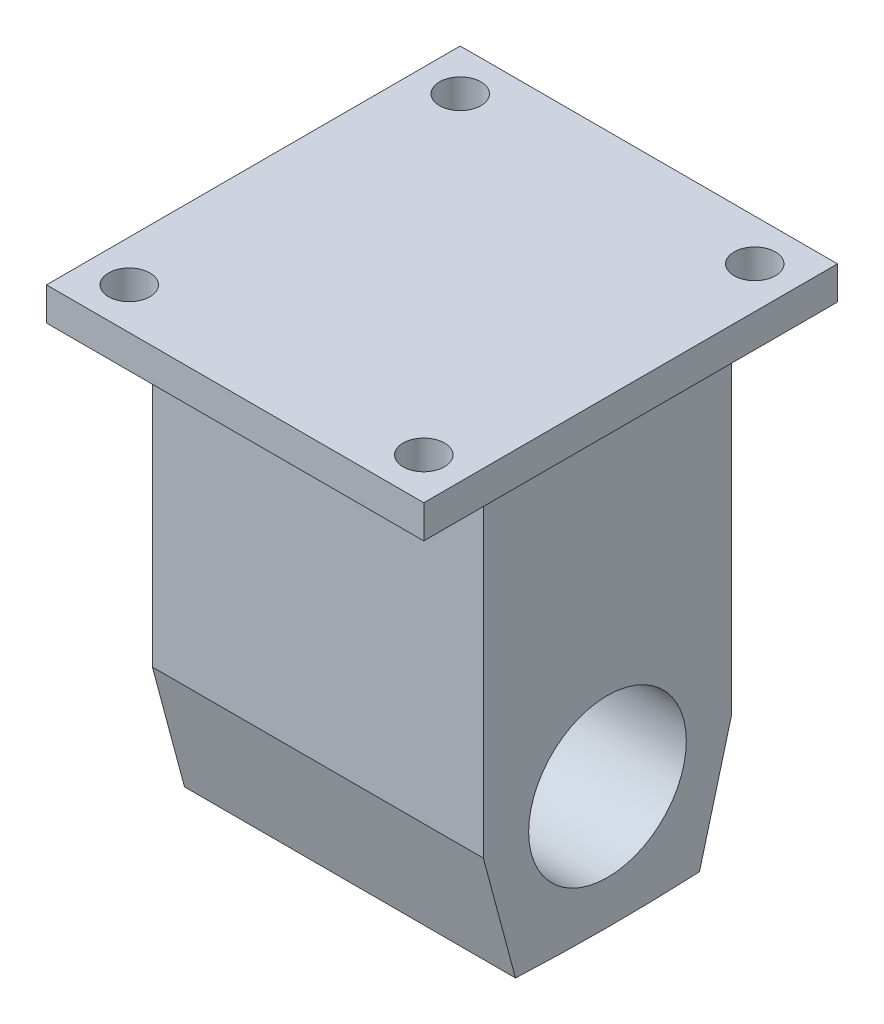
ISO-10303-21;
HEADER;
FILE_DESCRIPTION(('STEP AP214'),'2;1');
FILE_NAME('part.step','',(''),(''),'','','');
FILE_SCHEMA(('AUTOMOTIVE_DESIGN { 1 0 10303 214 1 1 1 1 }'));
ENDSEC;
DATA;
#1=APPLICATION_CONTEXT('core data for automotive mechanical design processes');
#2=APPLICATION_PROTOCOL_DEFINITION('international standard','automotive_design',2000,#1);
#3=PRODUCT_CONTEXT('',#1,'mechanical');
#4=PRODUCT('Part','Part','',(#3));
#5=PRODUCT_RELATED_PRODUCT_CATEGORY('part','',(#4));
#6=PRODUCT_DEFINITION_FORMATION('','',#4);
#7=PRODUCT_DEFINITION_CONTEXT('part definition',#1,'design');
#8=PRODUCT_DEFINITION('design','',#6,#7);
#9=PRODUCT_DEFINITION_SHAPE('','',#8);
#10=(LENGTH_UNIT() NAMED_UNIT(*) SI_UNIT(.MILLI.,.METRE.));
#11=(NAMED_UNIT(*) PLANE_ANGLE_UNIT() SI_UNIT($,.RADIAN.));
#12=(NAMED_UNIT(*) SI_UNIT($,.STERADIAN.) SOLID_ANGLE_UNIT());
#13=UNCERTAINTY_MEASURE_WITH_UNIT(LENGTH_MEASURE(1.E-05),#10,'distance_accuracy_value','');
#14=(GEOMETRIC_REPRESENTATION_CONTEXT(3) GLOBAL_UNCERTAINTY_ASSIGNED_CONTEXT((#13)) GLOBAL_UNIT_ASSIGNED_CONTEXT((#10,
#11,#12)) REPRESENTATION_CONTEXT('',''));
#15=CARTESIAN_POINT('',(0.,0.,0.));
#16=DIRECTION('',(0.,0.,1.));
#17=DIRECTION('',(1.,0.,0.));
#18=AXIS2_PLACEMENT_3D('',#15,#16,#17);
#19=CARTESIAN_POINT('',(25.4,50.292,19.05));
#20=DIRECTION('',(-1.,0.,0.));
#21=DIRECTION('',(0.,0.,1.));
#22=AXIS2_PLACEMENT_3D('',#19,#20,#21);
#23=PLANE('',#22);
#24=CARTESIAN_POINT('',(25.4,0.,0.));
#25=DIRECTION('',(1.,0.,0.));
#26=DIRECTION('',(0.,0.,-1.));
#27=AXIS2_PLACEMENT_3D('',#24,#25,#26);
#28=CIRCLE('',#27,12.1);
#29=CARTESIAN_POINT('',(25.4,0.,-12.1));
#30=VERTEX_POINT('',#29);
#31=EDGE_CURVE('E132',#30,#30,#28,.T.);
#32=ORIENTED_EDGE('',*,*,#31,.F.);
#33=EDGE_LOOP('',(#32));
#34=FACE_BOUND('',#33,.T.);
#35=DIRECTION('',(0.,-1.,0.));
#36=VECTOR('',#35,1.);
#37=CARTESIAN_POINT('',(25.4,50.292,19.05));
#38=LINE('',#37,#36);
#39=CARTESIAN_POINT('',(25.4,50.292,19.05));
#40=VERTEX_POINT('',#39);
#41=CARTESIAN_POINT('',(25.4,0.,19.05));
#42=VERTEX_POINT('',#41);
#43=EDGE_CURVE('E174',#40,#42,#38,.T.);
#44=ORIENTED_EDGE('',*,*,#43,.T.);
#45=DIRECTION('',(0.,-0.965925826289069,-0.258819045102518));
#46=VECTOR('',#45,1.);
#47=CARTESIAN_POINT('',(25.4,0.,19.05));
#48=LINE('',#47,#46);
#49=CARTESIAN_POINT('',(25.4,-18.4008869908068,14.119497190797));
#50=VERTEX_POINT('',#49);
#51=EDGE_CURVE('E143',#42,#50,#48,.T.);
#52=ORIENTED_EDGE('',*,*,#51,.T.);
#53=CARTESIAN_POINT('',(25.4,281.254621695724,4.34076685363883E-13));
#54=DIRECTION('',(-1.,0.,0.));
#55=DIRECTION('',(0.,0.,1.));
#56=AXIS2_PLACEMENT_3D('',#53,#54,#55);
#57=CIRCLE('',#56,299.987973237435);
#58=CARTESIAN_POINT('',(25.4,-18.4008869908067,-14.119497190797));
#59=VERTEX_POINT('',#58);
#60=EDGE_CURVE('E151',#59,#50,#57,.T.);
#61=ORIENTED_EDGE('',*,*,#60,.F.);
#62=DIRECTION('',(0.,-0.965925826289067,0.258819045102525));
#63=VECTOR('',#62,1.);
#64=CARTESIAN_POINT('',(25.4,0.,-19.05));
#65=LINE('',#64,#63);
#66=CARTESIAN_POINT('',(25.4,0.,-19.05));
#67=VERTEX_POINT('',#66);
#68=EDGE_CURVE('E149',#67,#59,#65,.T.);
#69=ORIENTED_EDGE('',*,*,#68,.F.);
#70=DIRECTION('',(0.,-1.,0.));
#71=VECTOR('',#70,1.);
#72=CARTESIAN_POINT('',(25.4,50.292,-19.05));
#73=LINE('',#72,#71);
#74=CARTESIAN_POINT('',(25.4,50.292,-19.05));
#75=VERTEX_POINT('',#74);
#76=EDGE_CURVE('E11',#75,#67,#73,.T.);
#77=ORIENTED_EDGE('',*,*,#76,.F.);
#78=DIRECTION('',(0.,0.,-1.));
#79=VECTOR('',#78,1.);
#80=CARTESIAN_POINT('',(25.4,50.292,19.05));
#81=LINE('',#80,#79);
#82=EDGE_CURVE('E161',#40,#75,#81,.T.);
#83=ORIENTED_EDGE('',*,*,#82,.F.);
#84=EDGE_LOOP('',(#44,#52,#61,#69,#77,#83));
#85=FACE_BOUND('',#84,.T.);
#86=ADVANCED_FACE('F33',(#34,#85),#23,.F.);
#87=CARTESIAN_POINT('',(-25.4,50.292,-19.05));
#88=DIRECTION('',(0.,0.,1.));
#89=DIRECTION('',(1.,0.,0.));
#90=AXIS2_PLACEMENT_3D('',#87,#88,#89);
#91=PLANE('',#90);
#92=DIRECTION('',(-1.,0.,0.));
#93=VECTOR('',#92,1.);
#94=CARTESIAN_POINT('',(-25.4,0.,-19.05));
#95=LINE('',#94,#93);
#96=CARTESIAN_POINT('',(-25.4,0.,-19.05));
#97=VERTEX_POINT('',#96);
#98=EDGE_CURVE('E160',#67,#97,#95,.T.);
#99=ORIENTED_EDGE('',*,*,#98,.T.);
#100=DIRECTION('',(0.,-1.,0.));
#101=VECTOR('',#100,1.);
#102=CARTESIAN_POINT('',(-25.4,50.292,-19.05));
#103=LINE('',#102,#101);
#104=CARTESIAN_POINT('',(-25.4,50.292,-19.05));
#105=VERTEX_POINT('',#104);
#106=EDGE_CURVE('E42',#105,#97,#103,.T.);
#107=ORIENTED_EDGE('',*,*,#106,.F.);
#108=DIRECTION('',(-1.,0.,0.));
#109=VECTOR('',#108,1.);
#110=CARTESIAN_POINT('',(-25.4,50.292,-19.05));
#111=LINE('',#110,#109);
#112=EDGE_CURVE('E164',#75,#105,#111,.T.);
#113=ORIENTED_EDGE('',*,*,#112,.F.);
#114=ORIENTED_EDGE('',*,*,#76,.T.);
#115=EDGE_LOOP('',(#99,#107,#113,#114));
#116=FACE_BOUND('',#115,.T.);
#117=ADVANCED_FACE('F187',(#116),#91,.F.);
#118=CARTESIAN_POINT('',(-25.4,50.292,19.05));
#119=DIRECTION('',(1.,0.,0.));
#120=DIRECTION('',(0.,0.,-1.));
#121=AXIS2_PLACEMENT_3D('',#118,#119,#120);
#122=PLANE('',#121);
#123=CARTESIAN_POINT('',(-25.4,0.,0.));
#124=DIRECTION('',(1.,0.,0.));
#125=DIRECTION('',(0.,0.,-1.));
#126=AXIS2_PLACEMENT_3D('',#123,#124,#125);
#127=CIRCLE('',#126,12.1);
#128=CARTESIAN_POINT('',(-25.4,0.,-12.1));
#129=VERTEX_POINT('',#128);
#130=EDGE_CURVE('E36',#129,#129,#127,.T.);
#131=ORIENTED_EDGE('',*,*,#130,.T.);
#132=EDGE_LOOP('',(#131));
#133=FACE_BOUND('',#132,.T.);
#134=ORIENTED_EDGE('',*,*,#106,.T.);
#135=DIRECTION('',(0.,-0.965925826289067,0.258819045102525));
#136=VECTOR('',#135,1.);
#137=CARTESIAN_POINT('',(-25.4,0.,-19.05));
#138=LINE('',#137,#136);
#139=CARTESIAN_POINT('',(-25.4,-18.4008869908067,-14.119497190797));
#140=VERTEX_POINT('',#139);
#141=EDGE_CURVE('E140',#97,#140,#138,.T.);
#142=ORIENTED_EDGE('',*,*,#141,.T.);
#143=CARTESIAN_POINT('',(-25.4,281.254621695724,4.34076685363883E-13));
#144=DIRECTION('',(-1.,0.,0.));
#145=DIRECTION('',(0.,0.,1.));
#146=AXIS2_PLACEMENT_3D('',#143,#144,#145);
#147=CIRCLE('',#146,299.987973237435);
#148=CARTESIAN_POINT('',(-25.4,-18.4008869908068,14.119497190797));
#149=VERTEX_POINT('',#148);
#150=EDGE_CURVE('E142',#140,#149,#147,.T.);
#151=ORIENTED_EDGE('',*,*,#150,.T.);
#152=DIRECTION('',(0.,-0.965925826289069,-0.258819045102518));
#153=VECTOR('',#152,1.);
#154=CARTESIAN_POINT('',(-25.4,0.,19.05));
#155=LINE('',#154,#153);
#156=CARTESIAN_POINT('',(-25.4,0.,19.05));
#157=VERTEX_POINT('',#156);
#158=EDGE_CURVE('E145',#157,#149,#155,.T.);
#159=ORIENTED_EDGE('',*,*,#158,.F.);
#160=DIRECTION('',(0.,-1.,0.));
#161=VECTOR('',#160,1.);
#162=CARTESIAN_POINT('',(-25.4,50.292,19.05));
#163=LINE('',#162,#161);
#164=CARTESIAN_POINT('',(-25.4,50.292,19.05));
#165=VERTEX_POINT('',#164);
#166=EDGE_CURVE('E49',#165,#157,#163,.T.);
#167=ORIENTED_EDGE('',*,*,#166,.F.);
#168=DIRECTION('',(0.,0.,1.));
#169=VECTOR('',#168,1.);
#170=CARTESIAN_POINT('',(-25.4,50.292,19.05));
#171=LINE('',#170,#169);
#172=EDGE_CURVE('E168',#105,#165,#171,.T.);
#173=ORIENTED_EDGE('',*,*,#172,.F.);
#174=EDGE_LOOP('',(#134,#142,#151,#159,#167,#173));
#175=FACE_BOUND('',#174,.T.);
#176=ADVANCED_FACE('F183',(#133,#175),#122,.F.);
#177=CARTESIAN_POINT('',(-25.4,50.292,19.05));
#178=DIRECTION('',(0.,0.,-1.));
#179=DIRECTION('',(-1.,0.,0.));
#180=AXIS2_PLACEMENT_3D('',#177,#178,#179);
#181=PLANE('',#180);
#182=DIRECTION('',(1.,0.,0.));
#183=VECTOR('',#182,1.);
#184=CARTESIAN_POINT('',(-25.4,0.,19.05));
#185=LINE('',#184,#183);
#186=EDGE_CURVE('E165',#157,#42,#185,.T.);
#187=ORIENTED_EDGE('',*,*,#186,.T.);
#188=ORIENTED_EDGE('',*,*,#43,.F.);
#189=DIRECTION('',(1.,0.,0.));
#190=VECTOR('',#189,1.);
#191=CARTESIAN_POINT('',(-25.4,50.292,19.05));
#192=LINE('',#191,#190);
#193=EDGE_CURVE('E171',#165,#40,#192,.T.);
#194=ORIENTED_EDGE('',*,*,#193,.F.);
#195=ORIENTED_EDGE('',*,*,#166,.T.);
#196=EDGE_LOOP('',(#187,#188,#194,#195));
#197=FACE_BOUND('',#196,.T.);
#198=ADVANCED_FACE('F199',(#197),#181,.F.);
#199=CARTESIAN_POINT('',(-25.4,0.,-19.05));
#200=DIRECTION('',(0.,0.258819045102525,0.965925826289067));
#201=DIRECTION('',(0.,-0.965925826289067,0.258819045102525));
#202=AXIS2_PLACEMENT_3D('',#199,#200,#201);
#203=PLANE('',#202);
#204=ORIENTED_EDGE('',*,*,#68,.T.);
#205=DIRECTION('',(1.,0.,0.));
#206=VECTOR('',#205,1.);
#207=CARTESIAN_POINT('',(-25.4,-18.4008869908067,-14.119497190797));
#208=LINE('',#207,#206);
#209=EDGE_CURVE('E157',#140,#59,#208,.T.);
#210=ORIENTED_EDGE('',*,*,#209,.F.);
#211=ORIENTED_EDGE('',*,*,#141,.F.);
#212=ORIENTED_EDGE('',*,*,#98,.F.);
#213=EDGE_LOOP('',(#204,#210,#211,#212));
#214=FACE_BOUND('',#213,.T.);
#215=ADVANCED_FACE('F191',(#214),#203,.F.);
#216=CARTESIAN_POINT('',(-25.4,281.254621695724,4.34076685363883E-13));
#217=DIRECTION('',(1.,0.,0.));
#218=DIRECTION('',(0.,0.,-1.));
#219=AXIS2_PLACEMENT_3D('',#216,#217,#218);
#220=CYLINDRICAL_SURFACE('',#219,299.987973237435);
#221=ORIENTED_EDGE('',*,*,#60,.T.);
#222=DIRECTION('',(1.,0.,0.));
#223=VECTOR('',#222,1.);
#224=CARTESIAN_POINT('',(-25.4,-18.4008869908068,14.119497190797));
#225=LINE('',#224,#223);
#226=EDGE_CURVE('E148',#149,#50,#225,.T.);
#227=ORIENTED_EDGE('',*,*,#226,.F.);
#228=ORIENTED_EDGE('',*,*,#150,.F.);
#229=ORIENTED_EDGE('',*,*,#209,.T.);
#230=EDGE_LOOP('',(#221,#227,#228,#229));
#231=FACE_BOUND('',#230,.T.);
#232=ADVANCED_FACE('F196',(#231),#220,.T.);
#233=CARTESIAN_POINT('',(-25.4,0.,19.05));
#234=DIRECTION('',(0.,-0.258819045102518,0.965925826289069));
#235=DIRECTION('',(0.,-0.965925826289069,-0.258819045102518));
#236=AXIS2_PLACEMENT_3D('',#233,#234,#235);
#237=PLANE('',#236);
#238=ORIENTED_EDGE('',*,*,#51,.F.);
#239=ORIENTED_EDGE('',*,*,#186,.F.);
#240=ORIENTED_EDGE('',*,*,#158,.T.);
#241=ORIENTED_EDGE('',*,*,#226,.T.);
#242=EDGE_LOOP('',(#238,#239,#240,#241));
#243=FACE_BOUND('',#242,.T.);
#244=ADVANCED_FACE('F204',(#243),#237,.T.);
#245=CARTESIAN_POINT('',(-101.6,0.,0.));
#246=DIRECTION('',(1.,0.,0.));
#247=DIRECTION('',(0.,0.,-1.));
#248=AXIS2_PLACEMENT_3D('',#245,#246,#247);
#249=CYLINDRICAL_SURFACE('',#248,12.1);
#250=ORIENTED_EDGE('',*,*,#31,.T.);
#251=EDGE_LOOP('',(#250));
#252=FACE_BOUND('',#251,.T.);
#253=ORIENTED_EDGE('',*,*,#130,.F.);
#254=EDGE_LOOP('',(#253));
#255=FACE_BOUND('',#254,.T.);
#256=ADVANCED_FACE('F206',(#252,#255),#249,.F.);
#257=CARTESIAN_POINT('',(0.,50.292,0.));
#258=DIRECTION('',(0.,1.,0.));
#259=DIRECTION('',(0.,0.,1.));
#260=AXIS2_PLACEMENT_3D('',#257,#258,#259);
#261=PLANE('',#260);
#262=CARTESIAN_POINT('',(-22.606,50.292,25.4));
#263=DIRECTION('',(0.,1.,0.));
#264=DIRECTION('',(0.,0.,-1.));
#265=AXIS2_PLACEMENT_3D('',#262,#263,#264);
#266=CIRCLE('',#265,3.175);
#267=CARTESIAN_POINT('',(-22.606,50.292,22.225));
#268=VERTEX_POINT('',#267);
#269=EDGE_CURVE('E372',#268,#268,#266,.T.);
#270=ORIENTED_EDGE('',*,*,#269,.T.);
#271=EDGE_LOOP('',(#270));
#272=FACE_BOUND('',#271,.T.);
#273=CARTESIAN_POINT('',(22.606,50.292,-25.4));
#274=DIRECTION('',(0.,1.,0.));
#275=DIRECTION('',(0.,0.,-1.));
#276=AXIS2_PLACEMENT_3D('',#273,#274,#275);
#277=CIRCLE('',#276,3.175);
#278=CARTESIAN_POINT('',(22.606,50.292,-28.575));
#279=VERTEX_POINT('',#278);
#280=EDGE_CURVE('E376',#279,#279,#277,.T.);
#281=ORIENTED_EDGE('',*,*,#280,.T.);
#282=EDGE_LOOP('',(#281));
#283=FACE_BOUND('',#282,.T.);
#284=CARTESIAN_POINT('',(22.606,50.292,25.4));
#285=DIRECTION('',(0.,1.,0.));
#286=DIRECTION('',(0.,0.,1.));
#287=AXIS2_PLACEMENT_3D('',#284,#285,#286);
#288=CIRCLE('',#287,3.175);
#289=CARTESIAN_POINT('',(22.606,50.292,28.575));
#290=VERTEX_POINT('',#289);
#291=EDGE_CURVE('E387',#290,#290,#288,.T.);
#292=ORIENTED_EDGE('',*,*,#291,.T.);
#293=EDGE_LOOP('',(#292));
#294=FACE_BOUND('',#293,.T.);
#295=CARTESIAN_POINT('',(-22.606,50.292,-25.4));
#296=DIRECTION('',(0.,1.,0.));
#297=DIRECTION('',(0.,0.,1.));
#298=AXIS2_PLACEMENT_3D('',#295,#296,#297);
#299=CIRCLE('',#298,3.175);
#300=CARTESIAN_POINT('',(-22.606,50.292,-22.225));
#301=VERTEX_POINT('',#300);
#302=EDGE_CURVE('E388',#301,#301,#299,.T.);
#303=ORIENTED_EDGE('',*,*,#302,.T.);
#304=EDGE_LOOP('',(#303));
#305=FACE_BOUND('',#304,.T.);
#306=DIRECTION('',(0.,0.,1.));
#307=VECTOR('',#306,1.);
#308=CARTESIAN_POINT('',(-28.956,50.292,31.75));
#309=LINE('',#308,#307);
#310=CARTESIAN_POINT('',(-28.956,50.292,-31.75));
#311=VERTEX_POINT('',#310);
#312=CARTESIAN_POINT('',(-28.956,50.292,31.75));
#313=VERTEX_POINT('',#312);
#314=EDGE_CURVE('E131',#311,#313,#309,.T.);
#315=ORIENTED_EDGE('',*,*,#314,.F.);
#316=DIRECTION('',(-1.,0.,0.));
#317=VECTOR('',#316,1.);
#318=CARTESIAN_POINT('',(28.956,50.292,-31.75));
#319=LINE('',#318,#317);
#320=CARTESIAN_POINT('',(28.956,50.292,-31.75));
#321=VERTEX_POINT('',#320);
#322=EDGE_CURVE('E127',#321,#311,#319,.T.);
#323=ORIENTED_EDGE('',*,*,#322,.F.);
#324=DIRECTION('',(0.,0.,-1.));
#325=VECTOR('',#324,1.);
#326=CARTESIAN_POINT('',(28.956,50.292,31.75));
#327=LINE('',#326,#325);
#328=CARTESIAN_POINT('',(28.956,50.292,31.75));
#329=VERTEX_POINT('',#328);
#330=EDGE_CURVE('E399',#329,#321,#327,.T.);
#331=ORIENTED_EDGE('',*,*,#330,.F.);
#332=DIRECTION('',(1.,0.,0.));
#333=VECTOR('',#332,1.);
#334=CARTESIAN_POINT('',(28.956,50.292,31.75));
#335=LINE('',#334,#333);
#336=EDGE_CURVE('E397',#313,#329,#335,.T.);
#337=ORIENTED_EDGE('',*,*,#336,.F.);
#338=EDGE_LOOP('',(#315,#323,#331,#337));
#339=FACE_BOUND('',#338,.T.);
#340=ORIENTED_EDGE('',*,*,#193,.T.);
#341=ORIENTED_EDGE('',*,*,#82,.T.);
#342=ORIENTED_EDGE('',*,*,#112,.T.);
#343=ORIENTED_EDGE('',*,*,#172,.T.);
#344=EDGE_LOOP('',(#340,#341,#342,#343));
#345=FACE_BOUND('',#344,.T.);
#346=ADVANCED_FACE('F202',(#272,#283,#294,#305,#339,#345),#261,.F.);
#347=CARTESIAN_POINT('',(-28.956,55.372,31.75));
#348=DIRECTION('',(1.,0.,0.));
#349=DIRECTION('',(0.,0.,-1.));
#350=AXIS2_PLACEMENT_3D('',#347,#348,#349);
#351=PLANE('',#350);
#352=ORIENTED_EDGE('',*,*,#314,.T.);
#353=DIRECTION('',(0.,-1.,0.));
#354=VECTOR('',#353,1.);
#355=CARTESIAN_POINT('',(-28.956,55.372,31.75));
#356=LINE('',#355,#354);
#357=CARTESIAN_POINT('',(-28.956,55.372,31.75));
#358=VERTEX_POINT('',#357);
#359=EDGE_CURVE('E111',#358,#313,#356,.T.);
#360=ORIENTED_EDGE('',*,*,#359,.F.);
#361=DIRECTION('',(0.,0.,1.));
#362=VECTOR('',#361,1.);
#363=CARTESIAN_POINT('',(-28.956,55.372,31.75));
#364=LINE('',#363,#362);
#365=CARTESIAN_POINT('',(-28.956,55.372,-31.75));
#366=VERTEX_POINT('',#365);
#367=EDGE_CURVE('E118',#366,#358,#364,.T.);
#368=ORIENTED_EDGE('',*,*,#367,.F.);
#369=DIRECTION('',(0.,-1.,0.));
#370=VECTOR('',#369,1.);
#371=CARTESIAN_POINT('',(-28.956,55.372,-31.75));
#372=LINE('',#371,#370);
#373=EDGE_CURVE('E395',#366,#311,#372,.T.);
#374=ORIENTED_EDGE('',*,*,#373,.T.);
#375=EDGE_LOOP('',(#352,#360,#368,#374));
#376=FACE_BOUND('',#375,.T.);
#377=ADVANCED_FACE('F129',(#376),#351,.F.);
#378=CARTESIAN_POINT('',(28.956,55.372,31.75));
#379=DIRECTION('',(0.,0.,-1.));
#380=DIRECTION('',(-1.,0.,0.));
#381=AXIS2_PLACEMENT_3D('',#378,#379,#380);
#382=PLANE('',#381);
#383=ORIENTED_EDGE('',*,*,#336,.T.);
#384=DIRECTION('',(0.,-1.,0.));
#385=VECTOR('',#384,1.);
#386=CARTESIAN_POINT('',(28.956,55.372,31.75));
#387=LINE('',#386,#385);
#388=CARTESIAN_POINT('',(28.956,55.372,31.75));
#389=VERTEX_POINT('',#388);
#390=EDGE_CURVE('E114',#389,#329,#387,.T.);
#391=ORIENTED_EDGE('',*,*,#390,.F.);
#392=DIRECTION('',(1.,0.,0.));
#393=VECTOR('',#392,1.);
#394=CARTESIAN_POINT('',(28.956,55.372,31.75));
#395=LINE('',#394,#393);
#396=EDGE_CURVE('E107',#358,#389,#395,.T.);
#397=ORIENTED_EDGE('',*,*,#396,.F.);
#398=ORIENTED_EDGE('',*,*,#359,.T.);
#399=EDGE_LOOP('',(#383,#391,#397,#398));
#400=FACE_BOUND('',#399,.T.);
#401=ADVANCED_FACE('F109',(#400),#382,.F.);
#402=CARTESIAN_POINT('',(28.956,55.372,31.75));
#403=DIRECTION('',(-1.,0.,0.));
#404=DIRECTION('',(0.,0.,1.));
#405=AXIS2_PLACEMENT_3D('',#402,#403,#404);
#406=PLANE('',#405);
#407=ORIENTED_EDGE('',*,*,#330,.T.);
#408=DIRECTION('',(0.,-1.,0.));
#409=VECTOR('',#408,1.);
#410=CARTESIAN_POINT('',(28.956,55.372,-31.75));
#411=LINE('',#410,#409);
#412=CARTESIAN_POINT('',(28.956,55.372,-31.75));
#413=VERTEX_POINT('',#412);
#414=EDGE_CURVE('E136',#413,#321,#411,.T.);
#415=ORIENTED_EDGE('',*,*,#414,.F.);
#416=DIRECTION('',(0.,0.,-1.));
#417=VECTOR('',#416,1.);
#418=CARTESIAN_POINT('',(28.956,55.372,31.75));
#419=LINE('',#418,#417);
#420=EDGE_CURVE('E117',#389,#413,#419,.T.);
#421=ORIENTED_EDGE('',*,*,#420,.F.);
#422=ORIENTED_EDGE('',*,*,#390,.T.);
#423=EDGE_LOOP('',(#407,#415,#421,#422));
#424=FACE_BOUND('',#423,.T.);
#425=ADVANCED_FACE('F290',(#424),#406,.F.);
#426=CARTESIAN_POINT('',(28.956,55.372,-31.75));
#427=DIRECTION('',(0.,0.,1.));
#428=DIRECTION('',(1.,0.,0.));
#429=AXIS2_PLACEMENT_3D('',#426,#427,#428);
#430=PLANE('',#429);
#431=ORIENTED_EDGE('',*,*,#322,.T.);
#432=ORIENTED_EDGE('',*,*,#373,.F.);
#433=DIRECTION('',(-1.,0.,0.));
#434=VECTOR('',#433,1.);
#435=CARTESIAN_POINT('',(28.956,55.372,-31.75));
#436=LINE('',#435,#434);
#437=EDGE_CURVE('E123',#413,#366,#436,.T.);
#438=ORIENTED_EDGE('',*,*,#437,.F.);
#439=ORIENTED_EDGE('',*,*,#414,.T.);
#440=EDGE_LOOP('',(#431,#432,#438,#439));
#441=FACE_BOUND('',#440,.T.);
#442=ADVANCED_FACE('F299',(#441),#430,.F.);
#443=CARTESIAN_POINT('',(0.,55.372,0.));
#444=DIRECTION('',(0.,1.,0.));
#445=DIRECTION('',(0.,0.,1.));
#446=AXIS2_PLACEMENT_3D('',#443,#444,#445);
#447=PLANE('',#446);
#448=CARTESIAN_POINT('',(-22.606,55.372,25.4));
#449=DIRECTION('',(0.,1.,0.));
#450=DIRECTION('',(0.,0.,-1.));
#451=AXIS2_PLACEMENT_3D('',#448,#449,#450);
#452=CIRCLE('',#451,3.175);
#453=CARTESIAN_POINT('',(-22.606,55.372,22.225));
#454=VERTEX_POINT('',#453);
#455=EDGE_CURVE('E375',#454,#454,#452,.T.);
#456=ORIENTED_EDGE('',*,*,#455,.F.);
#457=EDGE_LOOP('',(#456));
#458=FACE_BOUND('',#457,.T.);
#459=CARTESIAN_POINT('',(22.606,55.372,-25.4));
#460=DIRECTION('',(0.,1.,0.));
#461=DIRECTION('',(0.,0.,-1.));
#462=AXIS2_PLACEMENT_3D('',#459,#460,#461);
#463=CIRCLE('',#462,3.175);
#464=CARTESIAN_POINT('',(22.606,55.372,-28.575));
#465=VERTEX_POINT('',#464);
#466=EDGE_CURVE('E381',#465,#465,#463,.T.);
#467=ORIENTED_EDGE('',*,*,#466,.F.);
#468=EDGE_LOOP('',(#467));
#469=FACE_BOUND('',#468,.T.);
#470=CARTESIAN_POINT('',(22.606,55.372,25.4));
#471=DIRECTION('',(0.,1.,0.));
#472=DIRECTION('',(0.,0.,1.));
#473=AXIS2_PLACEMENT_3D('',#470,#471,#472);
#474=CIRCLE('',#473,3.175);
#475=CARTESIAN_POINT('',(22.606,55.372,28.575));
#476=VERTEX_POINT('',#475);
#477=EDGE_CURVE('E415',#476,#476,#474,.T.);
#478=ORIENTED_EDGE('',*,*,#477,.F.);
#479=EDGE_LOOP('',(#478));
#480=FACE_BOUND('',#479,.T.);
#481=CARTESIAN_POINT('',(-22.606,55.372,-25.4));
#482=DIRECTION('',(0.,1.,0.));
#483=DIRECTION('',(0.,0.,1.));
#484=AXIS2_PLACEMENT_3D('',#481,#482,#483);
#485=CIRCLE('',#484,3.175);
#486=CARTESIAN_POINT('',(-22.606,55.372,-22.225));
#487=VERTEX_POINT('',#486);
#488=EDGE_CURVE('E378',#487,#487,#485,.T.);
#489=ORIENTED_EDGE('',*,*,#488,.F.);
#490=EDGE_LOOP('',(#489));
#491=FACE_BOUND('',#490,.T.);
#492=ORIENTED_EDGE('',*,*,#367,.T.);
#493=ORIENTED_EDGE('',*,*,#396,.T.);
#494=ORIENTED_EDGE('',*,*,#420,.T.);
#495=ORIENTED_EDGE('',*,*,#437,.T.);
#496=EDGE_LOOP('',(#492,#493,#494,#495));
#497=FACE_BOUND('',#496,.T.);
#498=ADVANCED_FACE('F121',(#458,#469,#480,#491,#497),#447,.T.);
#499=CARTESIAN_POINT('',(-22.606,50.292,-25.4));
#500=DIRECTION('',(0.,1.,0.));
#501=DIRECTION('',(0.,0.,1.));
#502=AXIS2_PLACEMENT_3D('',#499,#500,#501);
#503=CYLINDRICAL_SURFACE('',#502,3.175);
#504=ORIENTED_EDGE('',*,*,#302,.F.);
#505=EDGE_LOOP('',(#504));
#506=FACE_BOUND('',#505,.T.);
#507=ORIENTED_EDGE('',*,*,#488,.T.);
#508=EDGE_LOOP('',(#507));
#509=FACE_BOUND('',#508,.T.);
#510=ADVANCED_FACE('F325',(#506,#509),#503,.F.);
#511=CARTESIAN_POINT('',(22.606,50.292,25.4));
#512=DIRECTION('',(0.,1.,0.));
#513=DIRECTION('',(0.,0.,1.));
#514=AXIS2_PLACEMENT_3D('',#511,#512,#513);
#515=CYLINDRICAL_SURFACE('',#514,3.175);
#516=ORIENTED_EDGE('',*,*,#291,.F.);
#517=EDGE_LOOP('',(#516));
#518=FACE_BOUND('',#517,.T.);
#519=ORIENTED_EDGE('',*,*,#477,.T.);
#520=EDGE_LOOP('',(#519));
#521=FACE_BOUND('',#520,.T.);
#522=ADVANCED_FACE('F335',(#518,#521),#515,.F.);
#523=CARTESIAN_POINT('',(22.606,50.292,-25.4));
#524=DIRECTION('',(0.,1.,0.));
#525=DIRECTION('',(0.,0.,1.));
#526=AXIS2_PLACEMENT_3D('',#523,#524,#525);
#527=CYLINDRICAL_SURFACE('',#526,3.175);
#528=ORIENTED_EDGE('',*,*,#280,.F.);
#529=EDGE_LOOP('',(#528));
#530=FACE_BOUND('',#529,.T.);
#531=ORIENTED_EDGE('',*,*,#466,.T.);
#532=EDGE_LOOP('',(#531));
#533=FACE_BOUND('',#532,.T.);
#534=ADVANCED_FACE('F345',(#530,#533),#527,.F.);
#535=CARTESIAN_POINT('',(-22.606,50.292,25.4));
#536=DIRECTION('',(0.,1.,0.));
#537=DIRECTION('',(0.,0.,1.));
#538=AXIS2_PLACEMENT_3D('',#535,#536,#537);
#539=CYLINDRICAL_SURFACE('',#538,3.175);
#540=ORIENTED_EDGE('',*,*,#269,.F.);
#541=EDGE_LOOP('',(#540));
#542=FACE_BOUND('',#541,.T.);
#543=ORIENTED_EDGE('',*,*,#455,.T.);
#544=EDGE_LOOP('',(#543));
#545=FACE_BOUND('',#544,.T.);
#546=ADVANCED_FACE('F355',(#542,#545),#539,.F.);
#547=CLOSED_SHELL('',(#86,#117,#176,#198,#215,#232,#244,#256,#346,#377,#401,#425,#442,#498,#510,
#522,#534,#546));
#548=MANIFOLD_SOLID_BREP('B2',#547);
#549=ADVANCED_BREP_SHAPE_REPRESENTATION('',(#18,#548),#14);
#550=SHAPE_DEFINITION_REPRESENTATION(#9,#549);
ENDSEC;
END-ISO-10303-21;
